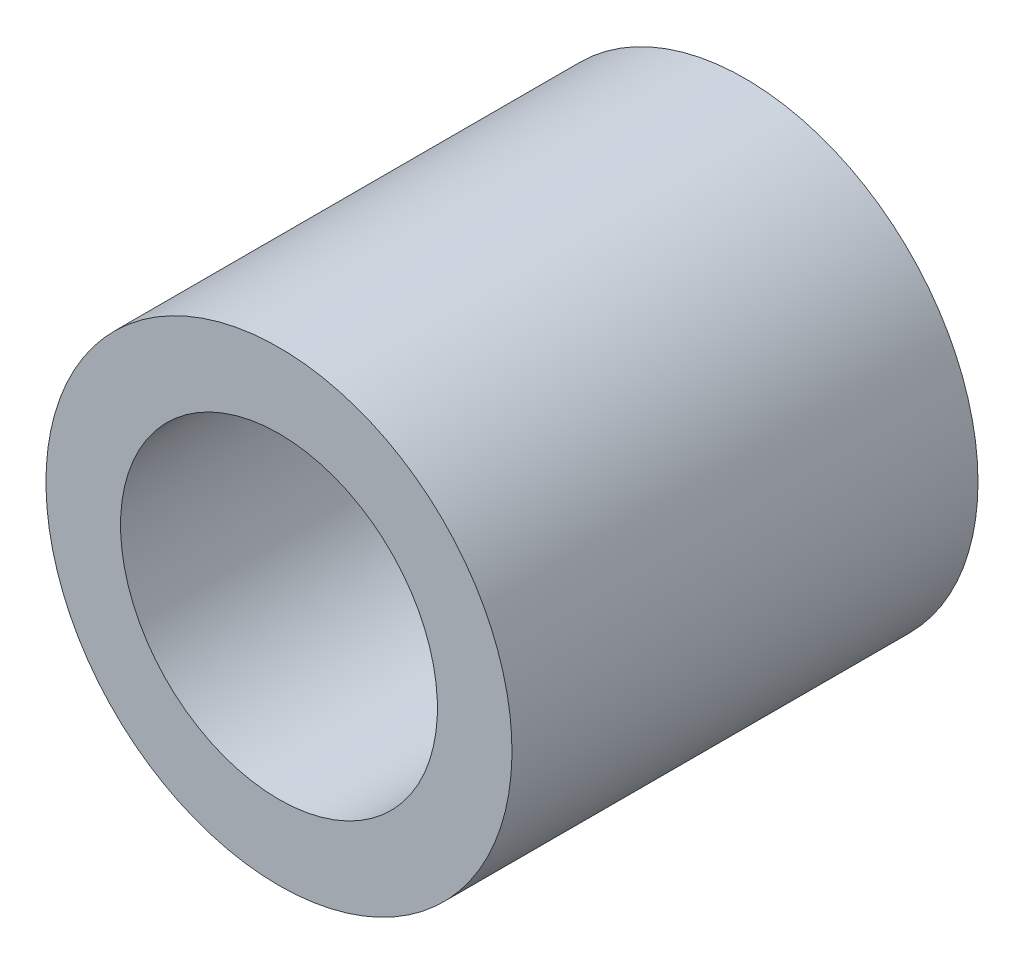
ISO-10303-21;
HEADER;
FILE_DESCRIPTION(('STEP AP214'),'2;1');
FILE_NAME('part.step','',(''),(''),'','','');
FILE_SCHEMA(('AUTOMOTIVE_DESIGN { 1 0 10303 214 1 1 1 1 }'));
ENDSEC;
DATA;
#1=APPLICATION_CONTEXT('core data for automotive mechanical design processes');
#2=APPLICATION_PROTOCOL_DEFINITION('international standard','automotive_design',2000,#1);
#3=PRODUCT_CONTEXT('',#1,'mechanical');
#4=PRODUCT('Part','Part','',(#3));
#5=PRODUCT_RELATED_PRODUCT_CATEGORY('part','',(#4));
#6=PRODUCT_DEFINITION_FORMATION('','',#4);
#7=PRODUCT_DEFINITION_CONTEXT('part definition',#1,'design');
#8=PRODUCT_DEFINITION('design','',#6,#7);
#9=PRODUCT_DEFINITION_SHAPE('','',#8);
#10=(LENGTH_UNIT() NAMED_UNIT(*) SI_UNIT(.MILLI.,.METRE.));
#11=(NAMED_UNIT(*) PLANE_ANGLE_UNIT() SI_UNIT($,.RADIAN.));
#12=(NAMED_UNIT(*) SI_UNIT($,.STERADIAN.) SOLID_ANGLE_UNIT());
#13=UNCERTAINTY_MEASURE_WITH_UNIT(LENGTH_MEASURE(1.E-05),#10,'distance_accuracy_value','');
#14=(GEOMETRIC_REPRESENTATION_CONTEXT(3) GLOBAL_UNCERTAINTY_ASSIGNED_CONTEXT((#13)) GLOBAL_UNIT_ASSIGNED_CONTEXT((#10,
#11,#12)) REPRESENTATION_CONTEXT('',''));
#15=CARTESIAN_POINT('',(0.,0.,0.));
#16=DIRECTION('',(0.,0.,1.));
#17=DIRECTION('',(1.,0.,0.));
#18=AXIS2_PLACEMENT_3D('',#15,#16,#17);
#19=CARTESIAN_POINT('',(-20.1525925660474,-28.52,12.0710678118655));
#20=DIRECTION('',(0.,0.,-1.));
#21=DIRECTION('',(-1.,0.,0.));
#22=AXIS2_PLACEMENT_3D('',#19,#20,#21);
#23=CYLINDRICAL_SURFACE('',#22,2.5);
#24=CARTESIAN_POINT('',(-20.1525925660474,-28.52,0.));
#25=DIRECTION('',(0.,0.,1.));
#26=DIRECTION('',(1.,0.,0.));
#27=AXIS2_PLACEMENT_3D('',#24,#25,#26);
#28=CIRCLE('',#27,2.5);
#29=CARTESIAN_POINT('',(-17.6525925660474,-28.52,0.));
#30=VERTEX_POINT('',#29);
#31=EDGE_CURVE('E46',#30,#30,#28,.T.);
#32=ORIENTED_EDGE('',*,*,#31,.T.);
#33=EDGE_LOOP('',(#32));
#34=FACE_BOUND('',#33,.T.);
#35=CARTESIAN_POINT('',(-20.1525925660474,-28.52,5.));
#36=DIRECTION('',(0.,0.,1.));
#37=DIRECTION('',(0.,-1.,0.));
#38=AXIS2_PLACEMENT_3D('',#35,#36,#37);
#39=CIRCLE('',#38,2.5);
#40=CARTESIAN_POINT('',(-20.1525925660474,-31.02,5.));
#41=VERTEX_POINT('',#40);
#42=EDGE_CURVE('E10',#41,#41,#39,.T.);
#43=ORIENTED_EDGE('',*,*,#42,.F.);
#44=EDGE_LOOP('',(#43));
#45=FACE_BOUND('',#44,.T.);
#46=ADVANCED_FACE('F35',(#34,#45),#23,.T.);
#47=CARTESIAN_POINT('',(-20.1525925660474,-28.52,0.));
#48=DIRECTION('',(0.,0.,1.));
#49=DIRECTION('',(1.,0.,0.));
#50=AXIS2_PLACEMENT_3D('',#47,#48,#49);
#51=PLANE('',#50);
#52=ORIENTED_EDGE('',*,*,#31,.F.);
#53=EDGE_LOOP('',(#52));
#54=FACE_BOUND('',#53,.T.);
#55=CARTESIAN_POINT('',(-20.1525925660474,-28.52,0.));
#56=DIRECTION('',(0.,0.,1.));
#57=DIRECTION('',(1.,0.,0.));
#58=AXIS2_PLACEMENT_3D('',#55,#56,#57);
#59=CIRCLE('',#58,1.7);
#60=CARTESIAN_POINT('',(-18.4525925660474,-28.52,0.));
#61=VERTEX_POINT('',#60);
#62=EDGE_CURVE('E48',#61,#61,#59,.T.);
#63=ORIENTED_EDGE('',*,*,#62,.T.);
#64=EDGE_LOOP('',(#63));
#65=FACE_BOUND('',#64,.T.);
#66=ADVANCED_FACE('F55',(#54,#65),#51,.F.);
#67=CARTESIAN_POINT('',(-20.1525925660474,-28.52,12.0710678118655));
#68=DIRECTION('',(0.,0.,-1.));
#69=DIRECTION('',(-1.,0.,0.));
#70=AXIS2_PLACEMENT_3D('',#67,#68,#69);
#71=CYLINDRICAL_SURFACE('',#70,1.7);
#72=ORIENTED_EDGE('',*,*,#62,.F.);
#73=EDGE_LOOP('',(#72));
#74=FACE_BOUND('',#73,.T.);
#75=CARTESIAN_POINT('',(-20.1525925660474,-28.52,5.));
#76=DIRECTION('',(0.,0.,1.));
#77=DIRECTION('',(0.,-1.,0.));
#78=AXIS2_PLACEMENT_3D('',#75,#76,#77);
#79=CIRCLE('',#78,1.7);
#80=CARTESIAN_POINT('',(-20.1525925660474,-30.22,5.));
#81=VERTEX_POINT('',#80);
#82=EDGE_CURVE('E38',#81,#81,#79,.T.);
#83=ORIENTED_EDGE('',*,*,#82,.T.);
#84=EDGE_LOOP('',(#83));
#85=FACE_BOUND('',#84,.T.);
#86=ADVANCED_FACE('F58',(#74,#85),#71,.F.);
#87=CARTESIAN_POINT('',(-44.2625925660474,-75.5,5.));
#88=DIRECTION('',(0.,0.,1.));
#89=DIRECTION('',(1.,0.,0.));
#90=AXIS2_PLACEMENT_3D('',#87,#88,#89);
#91=PLANE('',#90);
#92=ORIENTED_EDGE('',*,*,#82,.F.);
#93=EDGE_LOOP('',(#92));
#94=FACE_BOUND('',#93,.T.);
#95=ORIENTED_EDGE('',*,*,#42,.T.);
#96=EDGE_LOOP('',(#95));
#97=FACE_BOUND('',#96,.T.);
#98=ADVANCED_FACE('F63',(#94,#97),#91,.T.);
#99=CLOSED_SHELL('',(#46,#66,#86,#98));
#100=MANIFOLD_SOLID_BREP('B2',#99);
#101=ADVANCED_BREP_SHAPE_REPRESENTATION('',(#18,#100),#14);
#102=SHAPE_DEFINITION_REPRESENTATION(#9,#101);
ENDSEC;
END-ISO-10303-21;
